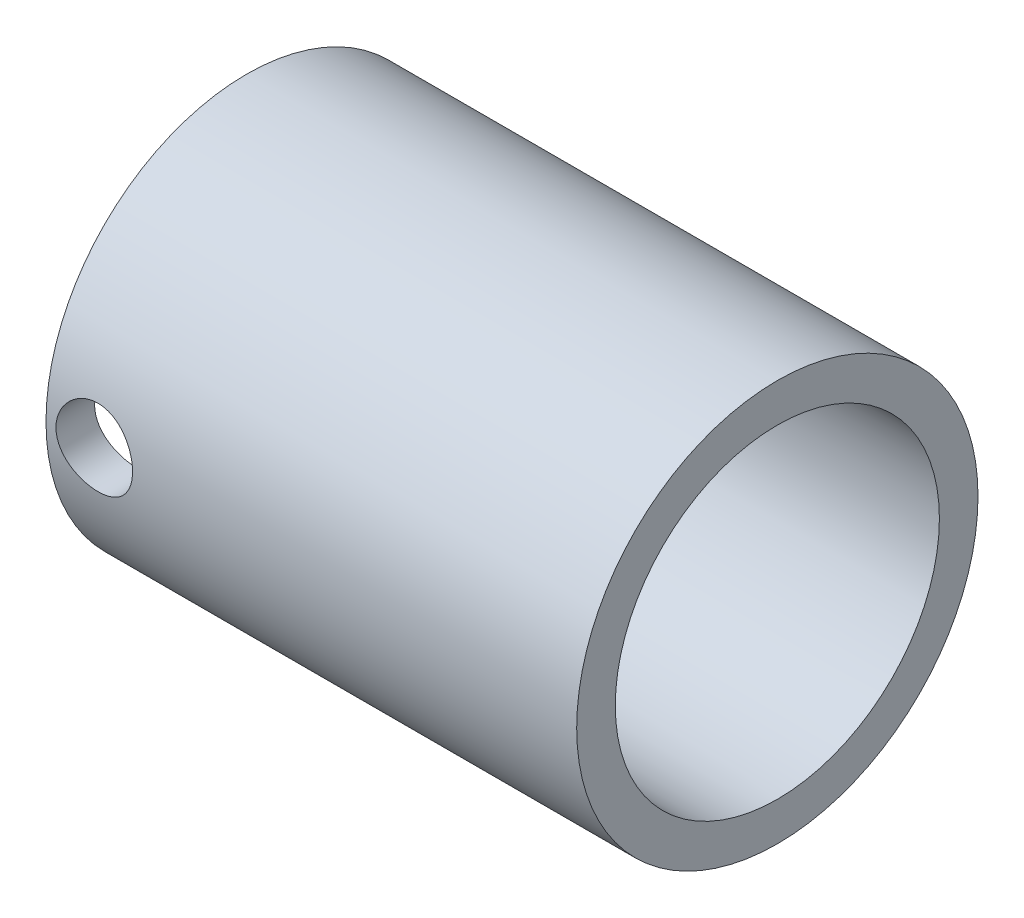
ISO-10303-21;
HEADER;
FILE_DESCRIPTION(('STEP AP214'),'2;1');
FILE_NAME('part.step','',(''),(''),'','','');
FILE_SCHEMA(('AUTOMOTIVE_DESIGN { 1 0 10303 214 1 1 1 1 }'));
ENDSEC;
DATA;
#1=APPLICATION_CONTEXT('core data for automotive mechanical design processes');
#2=APPLICATION_PROTOCOL_DEFINITION('international standard','automotive_design',2000,#1);
#3=PRODUCT_CONTEXT('',#1,'mechanical');
#4=PRODUCT('Part','Part','',(#3));
#5=PRODUCT_RELATED_PRODUCT_CATEGORY('part','',(#4));
#6=PRODUCT_DEFINITION_FORMATION('','',#4);
#7=PRODUCT_DEFINITION_CONTEXT('part definition',#1,'design');
#8=PRODUCT_DEFINITION('design','',#6,#7);
#9=PRODUCT_DEFINITION_SHAPE('','',#8);
#10=(LENGTH_UNIT() NAMED_UNIT(*) SI_UNIT(.MILLI.,.METRE.));
#11=(NAMED_UNIT(*) PLANE_ANGLE_UNIT() SI_UNIT($,.RADIAN.));
#12=(NAMED_UNIT(*) SI_UNIT($,.STERADIAN.) SOLID_ANGLE_UNIT());
#13=UNCERTAINTY_MEASURE_WITH_UNIT(LENGTH_MEASURE(1.E-05),#10,'distance_accuracy_value','');
#14=(GEOMETRIC_REPRESENTATION_CONTEXT(3) GLOBAL_UNCERTAINTY_ASSIGNED_CONTEXT((#13)) GLOBAL_UNIT_ASSIGNED_CONTEXT((#10,
#11,#12)) REPRESENTATION_CONTEXT('',''));
#15=CARTESIAN_POINT('',(0.,0.,0.));
#16=DIRECTION('',(0.,0.,1.));
#17=DIRECTION('',(1.,0.,0.));
#18=AXIS2_PLACEMENT_3D('',#15,#16,#17);
#19=CARTESIAN_POINT('',(-22.,0.,0.));
#20=DIRECTION('',(-1.,0.,0.));
#21=DIRECTION('',(0.,0.,1.));
#22=AXIS2_PLACEMENT_3D('',#19,#20,#21);
#23=CYLINDRICAL_SURFACE('',#22,16.637);
#24=CARTESIAN_POINT('',(-22.,0.,0.));
#25=DIRECTION('',(-1.,0.,0.));
#26=DIRECTION('',(0.,0.,1.));
#27=AXIS2_PLACEMENT_3D('',#24,#25,#26);
#28=CIRCLE('',#27,16.637);
#29=CARTESIAN_POINT('',(-22.,0.,16.637));
#30=VERTEX_POINT('',#29);
#31=EDGE_CURVE('E10',#30,#30,#28,.T.);
#32=ORIENTED_EDGE('',*,*,#31,.F.);
#33=EDGE_LOOP('',(#32));
#34=FACE_BOUND('',#33,.T.);
#35=CARTESIAN_POINT('',(22.,0.,0.));
#36=DIRECTION('',(-1.,0.,0.));
#37=DIRECTION('',(0.,0.,1.));
#38=AXIS2_PLACEMENT_3D('',#35,#36,#37);
#39=CIRCLE('',#38,16.637);
#40=CARTESIAN_POINT('',(22.,0.,16.637));
#41=VERTEX_POINT('',#40);
#42=EDGE_CURVE('E59',#41,#41,#39,.T.);
#43=ORIENTED_EDGE('',*,*,#42,.T.);
#44=EDGE_LOOP('',(#43));
#45=FACE_BOUND('',#44,.T.);
#46=CARTESIAN_POINT('',(-21.1750000000001,0.,16.637));
#47=CARTESIAN_POINT('',(-21.1749933140113,-0.176623043933461,16.6369967825455));
#48=CARTESIAN_POINT('',(-21.1602120725454,-0.353332423425379,16.6341583855795));
#49=CARTESIAN_POINT('',(-21.1015180369495,-0.701767621086007,16.6231090911614));
#50=CARTESIAN_POINT('',(-21.0575810334031,-0.873489173837261,16.614893729037));
#51=CARTESIAN_POINT('',(-20.941973051635,-1.20685955136267,16.5940090710491));
#52=CARTESIAN_POINT('',(-20.8703275182217,-1.36851745994236,16.5813438624639));
#53=CARTESIAN_POINT('',(-20.7014093510331,-1.67750425020077,16.5529409153484));
#54=CARTESIAN_POINT('',(-20.6041386476319,-1.82483421007652,16.5372034082809));
#55=CARTESIAN_POINT('',(-20.3854528261217,-2.10282166695771,16.5041736565355));
#56=CARTESIAN_POINT('',(-20.2637818146539,-2.23327606041258,16.4868661001376));
#57=CARTESIAN_POINT('',(-20.0002995352344,-2.47205179659933,16.452759972145));
#58=CARTESIAN_POINT('',(-19.8584867896573,-2.58037151407779,16.4359614380027));
#59=CARTESIAN_POINT('',(-19.5573045357171,-2.77265302096938,16.404626338857));
#60=CARTESIAN_POINT('',(-19.3978002741235,-2.85640723711796,16.3901095054076));
#61=CARTESIAN_POINT('',(-19.066661346563,-2.99585120911527,16.3651976542022));
#62=CARTESIAN_POINT('',(-18.8950277677331,-3.05154347649617,16.3548022675963));
#63=CARTESIAN_POINT('',(-18.5466786175523,-3.1326288487942,16.339464637844));
#64=CARTESIAN_POINT('',(-18.370048491012,-3.15837672295049,16.3344585978308));
#65=CARTESIAN_POINT('',(-18.0149098022273,-3.17994380488251,16.3302742035994));
#66=CARTESIAN_POINT('',(-17.8364014161117,-3.17576579434074,16.3310953077343));
#67=CARTESIAN_POINT('',(-17.4851502546875,-3.1378871584766,16.3384143748735));
#68=CARTESIAN_POINT('',(-17.3123620237534,-3.10459080075676,16.3448345985629));
#69=CARTESIAN_POINT('',(-16.9748700317399,-3.01005767390191,16.3625063218623));
#70=CARTESIAN_POINT('',(-16.8101666257171,-2.94881967888402,16.3737580334426));
#71=CARTESIAN_POINT('',(-16.4923414005859,-2.79974868740804,16.3999057469634));
#72=CARTESIAN_POINT('',(-16.3392976749188,-2.71175323860713,16.4148238997724));
#73=CARTESIAN_POINT('',(-16.0499959931134,-2.51178002784385,16.4466090608452));
#74=CARTESIAN_POINT('',(-15.9137398020147,-2.39979974750236,16.4634762736723));
#75=CARTESIAN_POINT('',(-15.6595460386329,-2.15285990088312,16.4975972682964));
#76=CARTESIAN_POINT('',(-15.5419441803572,-2.01755474455122,16.5148528631012));
#77=CARTESIAN_POINT('',(-15.3310561977708,-1.72896028642556,16.5475532975467));
#78=CARTESIAN_POINT('',(-15.2377703341734,-1.57567079183126,16.5629981177715));
#79=CARTESIAN_POINT('',(-15.0781096311257,-1.25510286119485,16.5903696822824));
#80=CARTESIAN_POINT('',(-15.0117706112659,-1.08780615957007,16.6022917381718));
#81=CARTESIAN_POINT('',(-14.9082309659054,-0.744165232189556,16.6212384299484));
#82=CARTESIAN_POINT('',(-14.8710271319219,-0.567822004952826,16.6282636050903));
#83=CARTESIAN_POINT('',(-14.8272833103124,-0.213981153801447,16.6365506478812));
#84=CARTESIAN_POINT('',(-14.8202834877554,-0.0365423364498004,16.6378989344422));
#85=CARTESIAN_POINT('',(-14.8359116384771,0.316970088029829,16.6349193452954));
#86=CARTESIAN_POINT('',(-14.8585381015459,0.493043764286124,16.6305917589171));
#87=CARTESIAN_POINT('',(-14.9323943031995,0.837362776395218,16.6168005602927));
#88=CARTESIAN_POINT('',(-14.9833905123032,1.00566003114842,16.6073788982015));
#89=CARTESIAN_POINT('',(-15.1122852504186,1.33131564307232,16.5844517338541));
#90=CARTESIAN_POINT('',(-15.1901856566577,1.48867323601275,16.5709459466382));
#91=CARTESIAN_POINT('',(-15.3716892253945,1.78993913909523,16.5411331242943));
#92=CARTESIAN_POINT('',(-15.4755722856431,1.93367580275029,16.5247962217868));
#93=CARTESIAN_POINT('',(-15.7057145958996,2.20184156308451,16.4912085657877));
#94=CARTESIAN_POINT('',(-15.8319760157543,2.32626878528845,16.4739577237928));
#95=CARTESIAN_POINT('',(-16.1053757860169,2.55403811271069,16.4401985616466));
#96=CARTESIAN_POINT('',(-16.2527779351995,2.65706591055033,16.4237037555002));
#97=CARTESIAN_POINT('',(-16.5630667962188,2.83689943570832,16.3935999241279));
#98=CARTESIAN_POINT('',(-16.7259529198871,2.91370615854206,16.3799907893514));
#99=CARTESIAN_POINT('',(-17.0618018479176,3.03847595129597,16.3573060439912));
#100=CARTESIAN_POINT('',(-17.2347103432552,3.08658096778471,16.3482081610744));
#101=CARTESIAN_POINT('',(-17.5863462321817,3.15301776960345,16.3355260761059));
#102=CARTESIAN_POINT('',(-17.7650729403298,3.17135304923702,16.3319412269497));
#103=CARTESIAN_POINT('',(-18.1201216453395,3.1776097213945,16.3307247375306));
#104=CARTESIAN_POINT('',(-18.2964347586919,3.16602712149722,16.3329960077207));
#105=CARTESIAN_POINT('',(-18.6445511016552,3.11386504403016,16.3430201274036));
#106=CARTESIAN_POINT('',(-18.816354360534,3.07328575469104,16.3507729413133));
#107=CARTESIAN_POINT('',(-19.1502945606414,2.96449464251114,16.3708450503635));
#108=CARTESIAN_POINT('',(-19.3124501945542,2.89633839337032,16.3831551573285));
#109=CARTESIAN_POINT('',(-19.6231036984671,2.73438299399241,16.4109609718057));
#110=CARTESIAN_POINT('',(-19.7716005547937,2.64058194259908,16.4264569154761));
#111=CARTESIAN_POINT('',(-20.0532019814104,2.42828310818708,16.4591886587564));
#112=CARTESIAN_POINT('',(-20.1860322959418,2.30942506266931,16.4764477031671));
#113=CARTESIAN_POINT('',(-20.4300278735523,2.05113551052336,16.5105889547641));
#114=CARTESIAN_POINT('',(-20.5411881533902,1.91169928465925,16.5274710744843));
#115=CARTESIAN_POINT('',(-20.7396649784882,1.61464344946643,16.5591422979615));
#116=CARTESIAN_POINT('',(-20.8267481367048,1.45686557676706,16.5739102882852));
#117=CARTESIAN_POINT('',(-20.9730302159293,1.12868487685696,16.599482740764));
#118=CARTESIAN_POINT('',(-21.0322550530307,0.958293954843729,16.6102908846143));
#119=CARTESIAN_POINT('',(-21.1092585530037,0.656193598544681,16.6245493534752));
#120=CARTESIAN_POINT('',(-21.1338689910982,0.526238575839304,16.6291917298036));
#121=CARTESIAN_POINT('',(-21.1667419945439,0.264205101894706,16.6354182151937));
#122=CARTESIAN_POINT('',(-21.1750050015994,0.132126708125741,16.6370024068868));
#123=CARTESIAN_POINT('',(-21.1750000000001,0.,16.637));
#124=B_SPLINE_CURVE_WITH_KNOTS('',3,(#46,#47,#48,#49,#50,#51,#52,#53,#54,#55,#56,#57,#58,#59,
#60,#61,#62,#63,#64,#65,#66,#67,#68,#69,#70,#71,#72,#73,#74,#75,#76,#77,#78,#79,#80,#81,#82,#83,
#84,#85,#86,#87,#88,#89,#90,#91,#92,#93,#94,#95,#96,#97,#98,#99,#100,#101,#102,#103,#104,#105,
#106,#107,#108,#109,#110,#111,#112,#113,#114,#115,#116,#117,#118,#119,#120,#121,#122,#123),
.UNSPECIFIED.,.T.,.F.,(4,2,2,2,2,2,2,2,2,2,2,2,2,2,2,2,2,2,2,2,2,2,2,2,2,2,2,2,2,2,2,2,2,2,2,2,
2,2,4),(0.,0.52938589365171,1.05921191256221,1.58855254184519,2.11785330667479,2.653026302528,
3.18823857970836,3.72785095919848,4.26741503503395,4.80051926401449,5.33357394032589,
5.85934332908121,6.38513578712443,6.91418647581355,7.44329274145895,7.98104478873198,
8.51880260148577,9.05727291777,9.59568392721468,10.1258684239707,10.656025895443,
11.1818825321209,11.7077758676085,12.2395987012272,12.7714731296044,13.3106795468992,
13.8498654902815,14.3863622547384,14.9227960418796,15.450393603812,15.9779877409002,
16.5045239124099,17.0310991288335,17.5658362335974,18.1006961618217,18.6405720951641,
19.1799447935027,19.5759741218519,19.9719927494255),.UNSPECIFIED.);
#125=CARTESIAN_POINT('',(-21.1750000000001,0.,16.637));
#126=VERTEX_POINT('',#125);
#127=EDGE_CURVE('E62',#126,#126,#124,.T.);
#128=ORIENTED_EDGE('',*,*,#127,.F.);
#129=EDGE_LOOP('',(#128));
#130=FACE_BOUND('',#129,.T.);
#131=ADVANCED_FACE('F31',(#34,#45,#130),#23,.T.);
#132=CARTESIAN_POINT('',(-1.5875,0.,0.));
#133=DIRECTION('',(-1.,0.,0.));
#134=DIRECTION('',(0.,0.,1.));
#135=AXIS2_PLACEMENT_3D('',#132,#133,#134);
#136=CONICAL_SURFACE('',#135,13.2842,0.00746587475486868);
#137=CARTESIAN_POINT('',(-1.5875,0.,0.));
#138=DIRECTION('',(-1.,0.,0.));
#139=DIRECTION('',(0.,0.,1.));
#140=AXIS2_PLACEMENT_3D('',#137,#138,#139);
#141=CIRCLE('',#140,13.2842);
#142=CARTESIAN_POINT('',(-1.5875,0.,13.2842));
#143=VERTEX_POINT('',#142);
#144=EDGE_CURVE('E41',#143,#143,#141,.T.);
#145=ORIENTED_EDGE('',*,*,#144,.F.);
#146=EDGE_LOOP('',(#145));
#147=FACE_BOUND('',#146,.T.);
#148=CARTESIAN_POINT('',(-22.,0.,0.));
#149=DIRECTION('',(-1.,0.,0.));
#150=DIRECTION('',(0.,0.,1.));
#151=AXIS2_PLACEMENT_3D('',#148,#149,#150);
#152=CIRCLE('',#151,13.4366);
#153=CARTESIAN_POINT('',(-22.,0.,13.4366));
#154=VERTEX_POINT('',#153);
#155=EDGE_CURVE('E37',#154,#154,#152,.T.);
#156=ORIENTED_EDGE('',*,*,#155,.T.);
#157=EDGE_LOOP('',(#156));
#158=FACE_BOUND('',#157,.T.);
#159=CARTESIAN_POINT('',(-20.2048410758327,-2.28457891750861,13.2273551945279));
#160=CARTESIAN_POINT('',(-20.3326998691633,-2.16117671032623,13.2496358741309));
#161=CARTESIAN_POINT('',(-20.45022799713,-2.02697800022574,13.271915790393));
#162=CARTESIAN_POINT('',(-20.6613812501981,-1.74050802191966,13.314102413066));
#163=CARTESIAN_POINT('',(-20.7549929387511,-1.58822666471934,13.3340077820946));
#164=CARTESIAN_POINT('',(-20.9155948006672,-1.26955826200157,13.3693163477132));
#165=CARTESIAN_POINT('',(-20.9825647936022,-1.10316063906843,13.3847161291047));
#166=CARTESIAN_POINT('',(-21.0876193847599,-0.761072191681601,13.4093007779098));
#167=CARTESIAN_POINT('',(-21.1257118935329,-0.585383926376347,13.4184873472645));
#168=CARTESIAN_POINT('',(-21.1713090065424,-0.233175040108244,13.4295229202207));
#169=CARTESIAN_POINT('',(-21.1793679168826,-0.0567303161806085,13.4315048765126));
#170=CARTESIAN_POINT('',(-21.1661607843604,0.294985435822317,13.4282861389088));
#171=CARTESIAN_POINT('',(-21.1448961882016,0.47025652137151,13.4230857993586));
#172=CARTESIAN_POINT('',(-21.0742434312353,0.812244021500843,13.4061826157172));
#173=CARTESIAN_POINT('',(-21.0252334291927,0.979043257486119,13.3945672567343));
#174=CARTESIAN_POINT('',(-20.9009058815487,1.30204702377861,13.3661047124934));
#175=CARTESIAN_POINT('',(-20.8255858432711,1.4582505485475,13.3492570315294));
#176=CARTESIAN_POINT('',(-20.6492951841381,1.75860920514931,13.3117218823396));
#177=CARTESIAN_POINT('',(-20.5479041283727,1.9025097383395,13.290973138046));
#178=CARTESIAN_POINT('',(-20.322912545411,2.17151099473029,13.2479817683559));
#179=CARTESIAN_POINT('',(-20.1993084456491,2.2966086878829,13.2257389030181));
#180=CARTESIAN_POINT('',(-19.9299758966278,2.52744843756681,13.1815515225965));
#181=CARTESIAN_POINT('',(-19.7837995530343,2.63267236204876,13.1596259937815));
#182=CARTESIAN_POINT('',(-19.4754355751348,2.81708785099809,13.1190328676039));
#183=CARTESIAN_POINT('',(-19.3132485165118,2.89628035101134,13.1003651531697));
#184=CARTESIAN_POINT('',(-18.9781974655754,3.02586252503178,13.0684758437141));
#185=CARTESIAN_POINT('',(-18.805393056724,3.07639910307705,13.0552265705447));
#186=CARTESIAN_POINT('',(-18.4533678656399,3.14758844075823,13.0355442944433));
#187=CARTESIAN_POINT('',(-18.2741483655772,3.16824713821952,13.029109937207));
#188=CARTESIAN_POINT('',(-17.9194318503853,3.17880325820804,13.0238118607715));
#189=CARTESIAN_POINT('',(-17.7439609968574,3.16949592558404,13.0247533594117));
#190=CARTESIAN_POINT('',(-17.3971263930101,3.12214687484892,13.033520874061));
#191=CARTESIAN_POINT('',(-17.2257625424401,3.08410585885665,13.041346721849));
#192=CARTESIAN_POINT('',(-16.893028921727,2.98083895134486,13.0627855141771));
#193=CARTESIAN_POINT('',(-16.7316030453916,2.91578563992847,13.0763617307722));
#194=CARTESIAN_POINT('',(-16.421828663841,2.76044100887426,13.1076690912238));
#195=CARTESIAN_POINT('',(-16.2734819273091,2.67014628272141,13.1254007958418));
#196=CARTESIAN_POINT('',(-15.9904615608228,2.46448096472,13.1634337094242));
#197=CARTESIAN_POINT('',(-15.8561729452501,2.34858953764594,13.1837839527172));
#198=CARTESIAN_POINT('',(-15.6087039288419,2.09608797979743,13.2244059298222));
#199=CARTESIAN_POINT('',(-15.4955258411687,1.95947558151595,13.2446776547926));
#200=CARTESIAN_POINT('',(-15.2917295459121,1.66678987751984,13.283174059533));
#201=CARTESIAN_POINT('',(-15.2014965858766,1.51044287614653,13.3013612790345));
#202=CARTESIAN_POINT('',(-15.0486687041944,1.1843485463125,13.3332046289088));
#203=CARTESIAN_POINT('',(-14.9860707935358,1.01460266941885,13.3468612492724));
#204=CARTESIAN_POINT('',(-14.8912080010864,0.669081321931121,13.3678943640476));
#205=CARTESIAN_POINT('',(-14.8585212289465,0.493427140205158,13.3753580632431));
#206=CARTESIAN_POINT('',(-14.8230484364193,0.138979460754092,13.3834683734374));
#207=CARTESIAN_POINT('',(-14.820258279946,-0.0398135992906104,13.3841159274244));
#208=CARTESIAN_POINT('',(-14.8444092157212,-0.391550729231042,13.3785803560726));
#209=CARTESIAN_POINT('',(-14.8707392073793,-0.564539424870003,13.3725376267851));
#210=CARTESIAN_POINT('',(-14.951301664048,-0.903561731717757,13.3545189509701));
#211=CARTESIAN_POINT('',(-15.0055350062391,-1.06959512409947,13.3425428179182));
#212=CARTESIAN_POINT('',(-15.1405808967735,-1.39100272570687,13.313898600326));
#213=CARTESIAN_POINT('',(-15.2215245644594,-1.54631968726193,13.2972074293362));
#214=CARTESIAN_POINT('',(-15.40760883243,-1.84134793730725,13.2609778648323));
#215=CARTESIAN_POINT('',(-15.5127530543401,-1.98105688539733,13.2414390453268));
#216=CARTESIAN_POINT('',(-15.7471240066378,-2.24431297562516,13.2011769247941));
#217=CARTESIAN_POINT('',(-15.8768497444072,-2.36741363187891,13.1804367059023));
#218=CARTESIAN_POINT('',(-16.1552603697969,-2.59024204942024,13.1405841893051));
#219=CARTESIAN_POINT('',(-16.3039462411794,-2.6899685971605,13.121471976156));
#220=CARTESIAN_POINT('',(-16.6172294713619,-2.86370964369854,13.0870526652218));
#221=CARTESIAN_POINT('',(-16.7819145759131,-2.93757078445776,13.0717684109338));
#222=CARTESIAN_POINT('',(-17.121799477833,-3.05643332273481,13.0470968940784));
#223=CARTESIAN_POINT('',(-17.2969971997689,-3.10144039634344,13.0377084717069));
#224=CARTESIAN_POINT('',(-17.6487382293964,-3.16043171475405,13.0262357554218));
#225=CARTESIAN_POINT('',(-17.825163856329,-3.17508712760742,13.0239928351767));
#226=CARTESIAN_POINT('',(-18.1779534723786,-3.17491210720201,13.0267467482013));
#227=CARTESIAN_POINT('',(-18.3543174604978,-3.1600812168971,13.0317436936908));
#228=CARTESIAN_POINT('',(-18.699132701903,-3.10192721464626,13.0483515506656));
#229=CARTESIAN_POINT('',(-18.8676638993367,-3.05904540507881,13.0598596546444));
#230=CARTESIAN_POINT('',(-19.1950287571396,-2.94660185544639,13.0881913798675));
#231=CARTESIAN_POINT('',(-19.3538664968398,-2.87705142943383,13.1050127464492));
#232=CARTESIAN_POINT('',(-19.633407157732,-2.72646985251072,13.1392162980679));
#233=CARTESIAN_POINT('',(-19.7561441659139,-2.64905939513288,13.1560775460935));
#234=CARTESIAN_POINT('',(-19.989817208272,-2.47834476131026,13.1910777045453));
#235=CARTESIAN_POINT('',(-20.1007524328198,-2.38503949558724,13.2092167024863));
#236=CARTESIAN_POINT('',(-20.2048410758327,-2.28457891750861,13.2273551945279));
#237=B_SPLINE_CURVE_WITH_KNOTS('',3,(#159,#160,#161,#162,#163,#164,#165,#166,#167,#168,#169,
#170,#171,#172,#173,#174,#175,#176,#177,#178,#179,#180,#181,#182,#183,#184,#185,#186,#187,#188,
#189,#190,#191,#192,#193,#194,#195,#196,#197,#198,#199,#200,#201,#202,#203,#204,#205,#206,#207,
#208,#209,#210,#211,#212,#213,#214,#215,#216,#217,#218,#219,#220,#221,#222,#223,#224,#225,#226,
#227,#228,#229,#230,#231,#232,#233,#234,#235,#236),.UNSPECIFIED.,.T.,.F.,(4,2,2,2,2,2,2,2,2,2,2,
2,2,2,2,2,2,2,2,2,2,2,2,2,2,2,2,2,2,2,2,2,2,2,2,2,2,2,4),(0.,0.536750925324293,1.07380274404096,
1.61126059520488,2.1485711646625,2.67591447200091,3.20323176327967,3.7235292305675,
4.24387600546591,4.77320722246057,5.30262364910109,5.84435931995487,6.38607551918914,
6.92498891323943,7.46379519080429,7.98842155340386,8.51303509696687,9.0343472629206,
9.55572981778913,10.0889015688411,10.6221317073155,11.1637980543619,11.7054058003153,
12.2392509321754,12.7730222075856,13.2958010226642,13.8185962730257,14.3439970495732,
14.8694765038012,15.4070619479281,15.9446752964749,16.485424275073,17.0260668463886,
17.5546206541356,18.0831826546816,18.6036229701751,19.1238427348289,19.5607766675322,
19.9977405555656),.UNSPECIFIED.);
#238=CARTESIAN_POINT('',(-20.2048410758327,-2.28457891750861,13.2273551945279));
#239=VERTEX_POINT('',#238);
#240=EDGE_CURVE('E69',#239,#239,#237,.T.);
#241=ORIENTED_EDGE('',*,*,#240,.F.);
#242=EDGE_LOOP('',(#241));
#243=FACE_BOUND('',#242,.T.);
#244=ADVANCED_FACE('F102',(#147,#158,#243),#136,.F.);
#245=CARTESIAN_POINT('',(-22.,-16.637,0.));
#246=DIRECTION('',(-1.,0.,0.));
#247=DIRECTION('',(0.,0.,1.));
#248=AXIS2_PLACEMENT_3D('',#245,#246,#247);
#249=PLANE('',#248);
#250=ORIENTED_EDGE('',*,*,#31,.T.);
#251=EDGE_LOOP('',(#250));
#252=FACE_BOUND('',#251,.T.);
#253=ORIENTED_EDGE('',*,*,#155,.F.);
#254=EDGE_LOOP('',(#253));
#255=FACE_BOUND('',#254,.T.);
#256=ADVANCED_FACE('F100',(#252,#255),#249,.T.);
#257=CARTESIAN_POINT('',(-1.5875,-13.2842,0.));
#258=DIRECTION('',(-1.,0.,0.));
#259=DIRECTION('',(0.,0.,1.));
#260=AXIS2_PLACEMENT_3D('',#257,#258,#259);
#261=PLANE('',#260);
#262=ORIENTED_EDGE('',*,*,#144,.T.);
#263=EDGE_LOOP('',(#262));
#264=FACE_BOUND('',#263,.T.);
#265=CARTESIAN_POINT('',(-1.5875,0.,0.));
#266=DIRECTION('',(-1.,0.,0.));
#267=DIRECTION('',(0.,0.,1.));
#268=AXIS2_PLACEMENT_3D('',#265,#266,#267);
#269=CIRCLE('',#268,10.4648);
#270=CARTESIAN_POINT('',(-1.5875,0.,10.4648));
#271=VERTEX_POINT('',#270);
#272=EDGE_CURVE('E45',#271,#271,#269,.T.);
#273=ORIENTED_EDGE('',*,*,#272,.F.);
#274=EDGE_LOOP('',(#273));
#275=FACE_BOUND('',#274,.T.);
#276=ADVANCED_FACE('F96',(#264,#275),#261,.T.);
#277=CARTESIAN_POINT('',(-22.,0.,0.));
#278=DIRECTION('',(-1.,0.,0.));
#279=DIRECTION('',(0.,0.,1.));
#280=AXIS2_PLACEMENT_3D('',#277,#278,#279);
#281=CYLINDRICAL_SURFACE('',#280,10.4648);
#282=ORIENTED_EDGE('',*,*,#272,.T.);
#283=EDGE_LOOP('',(#282));
#284=FACE_BOUND('',#283,.T.);
#285=CARTESIAN_POINT('',(1.5875,0.,0.));
#286=DIRECTION('',(-1.,0.,0.));
#287=DIRECTION('',(0.,0.,1.));
#288=AXIS2_PLACEMENT_3D('',#285,#286,#287);
#289=CIRCLE('',#288,10.4648);
#290=CARTESIAN_POINT('',(1.5875,0.,10.4648));
#291=VERTEX_POINT('',#290);
#292=EDGE_CURVE('E50',#291,#291,#289,.T.);
#293=ORIENTED_EDGE('',*,*,#292,.F.);
#294=EDGE_LOOP('',(#293));
#295=FACE_BOUND('',#294,.T.);
#296=ADVANCED_FACE('F92',(#284,#295),#281,.F.);
#297=CARTESIAN_POINT('',(1.5875,-13.2842,0.));
#298=DIRECTION('',(1.,0.,0.));
#299=DIRECTION('',(0.,0.,-1.));
#300=AXIS2_PLACEMENT_3D('',#297,#298,#299);
#301=PLANE('',#300);
#302=ORIENTED_EDGE('',*,*,#292,.T.);
#303=EDGE_LOOP('',(#302));
#304=FACE_BOUND('',#303,.T.);
#305=CARTESIAN_POINT('',(1.5875,0.,0.));
#306=DIRECTION('',(-1.,0.,0.));
#307=DIRECTION('',(0.,0.,1.));
#308=AXIS2_PLACEMENT_3D('',#305,#306,#307);
#309=CIRCLE('',#308,13.2842);
#310=CARTESIAN_POINT('',(1.5875,0.,13.2842));
#311=VERTEX_POINT('',#310);
#312=EDGE_CURVE('E53',#311,#311,#309,.T.);
#313=ORIENTED_EDGE('',*,*,#312,.F.);
#314=EDGE_LOOP('',(#313));
#315=FACE_BOUND('',#314,.T.);
#316=ADVANCED_FACE('F88',(#304,#315),#301,.T.);
#317=CARTESIAN_POINT('',(22.,0.,0.));
#318=DIRECTION('',(1.,0.,0.));
#319=DIRECTION('',(0.,0.,-1.));
#320=AXIS2_PLACEMENT_3D('',#317,#318,#319);
#321=CONICAL_SURFACE('',#320,13.4366,0.00746587475486843);
#322=ORIENTED_EDGE('',*,*,#312,.T.);
#323=EDGE_LOOP('',(#322));
#324=FACE_BOUND('',#323,.T.);
#325=CARTESIAN_POINT('',(22.,0.,0.));
#326=DIRECTION('',(-1.,0.,0.));
#327=DIRECTION('',(0.,0.,1.));
#328=AXIS2_PLACEMENT_3D('',#325,#326,#327);
#329=CIRCLE('',#328,13.4366);
#330=CARTESIAN_POINT('',(22.,0.,13.4366));
#331=VERTEX_POINT('',#330);
#332=EDGE_CURVE('E56',#331,#331,#329,.T.);
#333=ORIENTED_EDGE('',*,*,#332,.F.);
#334=EDGE_LOOP('',(#333));
#335=FACE_BOUND('',#334,.T.);
#336=ADVANCED_FACE('F84',(#324,#335),#321,.F.);
#337=CARTESIAN_POINT('',(22.,-16.637,0.));
#338=DIRECTION('',(1.,0.,0.));
#339=DIRECTION('',(0.,0.,-1.));
#340=AXIS2_PLACEMENT_3D('',#337,#338,#339);
#341=PLANE('',#340);
#342=ORIENTED_EDGE('',*,*,#332,.T.);
#343=EDGE_LOOP('',(#342));
#344=FACE_BOUND('',#343,.T.);
#345=ORIENTED_EDGE('',*,*,#42,.F.);
#346=EDGE_LOOP('',(#345));
#347=FACE_BOUND('',#346,.T.);
#348=ADVANCED_FACE('F79',(#344,#347),#341,.T.);
#349=CARTESIAN_POINT('',(-18.,0.,16.638));
#350=DIRECTION('',(0.,0.,-1.));
#351=DIRECTION('',(-1.,0.,0.));
#352=AXIS2_PLACEMENT_3D('',#349,#350,#351);
#353=CYLINDRICAL_SURFACE('',#352,3.17500000000008);
#354=ORIENTED_EDGE('',*,*,#127,.T.);
#355=EDGE_LOOP('',(#354));
#356=FACE_BOUND('',#355,.T.);
#357=ORIENTED_EDGE('',*,*,#240,.T.);
#358=EDGE_LOOP('',(#357));
#359=FACE_BOUND('',#358,.T.);
#360=ADVANCED_FACE('F73',(#356,#359),#353,.F.);
#361=CLOSED_SHELL('',(#131,#244,#256,#276,#296,#316,#336,#348,#360));
#362=MANIFOLD_SOLID_BREP('B2',#361);
#363=ADVANCED_BREP_SHAPE_REPRESENTATION('',(#18,#362),#14);
#364=SHAPE_DEFINITION_REPRESENTATION(#9,#363);
ENDSEC;
END-ISO-10303-21;
